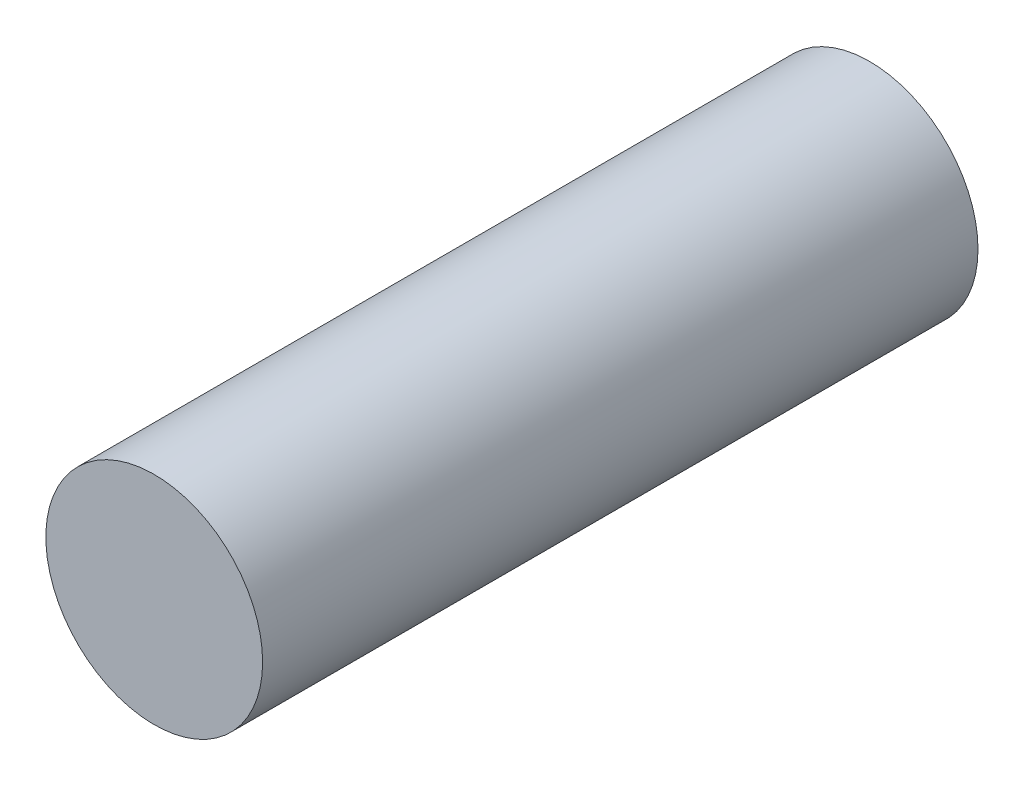
ISO-10303-21;
HEADER;
FILE_DESCRIPTION(('STEP AP214'),'2;1');
FILE_NAME('part.step','',(''),(''),'','','');
FILE_SCHEMA(('AUTOMOTIVE_DESIGN { 1 0 10303 214 1 1 1 1 }'));
ENDSEC;
DATA;
#1=APPLICATION_CONTEXT('core data for automotive mechanical design processes');
#2=APPLICATION_PROTOCOL_DEFINITION('international standard','automotive_design',2000,#1);
#3=PRODUCT_CONTEXT('',#1,'mechanical');
#4=PRODUCT('Part','Part','',(#3));
#5=PRODUCT_RELATED_PRODUCT_CATEGORY('part','',(#4));
#6=PRODUCT_DEFINITION_FORMATION('','',#4);
#7=PRODUCT_DEFINITION_CONTEXT('part definition',#1,'design');
#8=PRODUCT_DEFINITION('design','',#6,#7);
#9=PRODUCT_DEFINITION_SHAPE('','',#8);
#10=(LENGTH_UNIT() NAMED_UNIT(*) SI_UNIT(.MILLI.,.METRE.));
#11=(NAMED_UNIT(*) PLANE_ANGLE_UNIT() SI_UNIT($,.RADIAN.));
#12=(NAMED_UNIT(*) SI_UNIT($,.STERADIAN.) SOLID_ANGLE_UNIT());
#13=UNCERTAINTY_MEASURE_WITH_UNIT(LENGTH_MEASURE(1.E-05),#10,'distance_accuracy_value','');
#14=(GEOMETRIC_REPRESENTATION_CONTEXT(3) GLOBAL_UNCERTAINTY_ASSIGNED_CONTEXT((#13)) GLOBAL_UNIT_ASSIGNED_CONTEXT((#10,
#11,#12)) REPRESENTATION_CONTEXT('',''));
#15=CARTESIAN_POINT('',(0.,0.,0.));
#16=DIRECTION('',(0.,0.,1.));
#17=DIRECTION('',(1.,0.,0.));
#18=AXIS2_PLACEMENT_3D('',#15,#16,#17);
#19=CARTESIAN_POINT('',(0.,0.,41.91));
#20=DIRECTION('',(0.,0.,-1.));
#21=DIRECTION('',(-1.,0.,0.));
#22=AXIS2_PLACEMENT_3D('',#19,#20,#21);
#23=CYLINDRICAL_SURFACE('',#22,6.35);
#24=CARTESIAN_POINT('',(0.,0.,41.91));
#25=DIRECTION('',(0.,0.,1.));
#26=DIRECTION('',(1.,0.,0.));
#27=AXIS2_PLACEMENT_3D('',#24,#25,#26);
#28=CIRCLE('',#27,6.35);
#29=CARTESIAN_POINT('',(6.35,0.,41.91));
#30=VERTEX_POINT('',#29);
#31=EDGE_CURVE('E10',#30,#30,#28,.T.);
#32=ORIENTED_EDGE('',*,*,#31,.F.);
#33=EDGE_LOOP('',(#32));
#34=FACE_BOUND('',#33,.T.);
#35=CARTESIAN_POINT('',(0.,0.,0.));
#36=DIRECTION('',(0.,0.,1.));
#37=DIRECTION('',(1.,0.,0.));
#38=AXIS2_PLACEMENT_3D('',#35,#36,#37);
#39=CIRCLE('',#38,6.35);
#40=CARTESIAN_POINT('',(6.35,0.,0.));
#41=VERTEX_POINT('',#40);
#42=EDGE_CURVE('E34',#41,#41,#39,.T.);
#43=ORIENTED_EDGE('',*,*,#42,.T.);
#44=EDGE_LOOP('',(#43));
#45=FACE_BOUND('',#44,.T.);
#46=ADVANCED_FACE('F31',(#34,#45),#23,.T.);
#47=CARTESIAN_POINT('',(0.,0.,41.91));
#48=DIRECTION('',(0.,0.,1.));
#49=DIRECTION('',(1.,0.,0.));
#50=AXIS2_PLACEMENT_3D('',#47,#48,#49);
#51=PLANE('',#50);
#52=ORIENTED_EDGE('',*,*,#31,.T.);
#53=EDGE_LOOP('',(#52));
#54=FACE_BOUND('',#53,.T.);
#55=ADVANCED_FACE('F46',(#54),#51,.T.);
#56=CARTESIAN_POINT('',(0.,0.,0.));
#57=DIRECTION('',(0.,0.,1.));
#58=DIRECTION('',(1.,0.,0.));
#59=AXIS2_PLACEMENT_3D('',#56,#57,#58);
#60=PLANE('',#59);
#61=ORIENTED_EDGE('',*,*,#42,.F.);
#62=EDGE_LOOP('',(#61));
#63=FACE_BOUND('',#62,.T.);
#64=ADVANCED_FACE('F44',(#63),#60,.F.);
#65=CLOSED_SHELL('',(#46,#55,#64));
#66=MANIFOLD_SOLID_BREP('B2',#65);
#67=ADVANCED_BREP_SHAPE_REPRESENTATION('',(#18,#66),#14);
#68=SHAPE_DEFINITION_REPRESENTATION(#9,#67);
ENDSEC;
END-ISO-10303-21;
